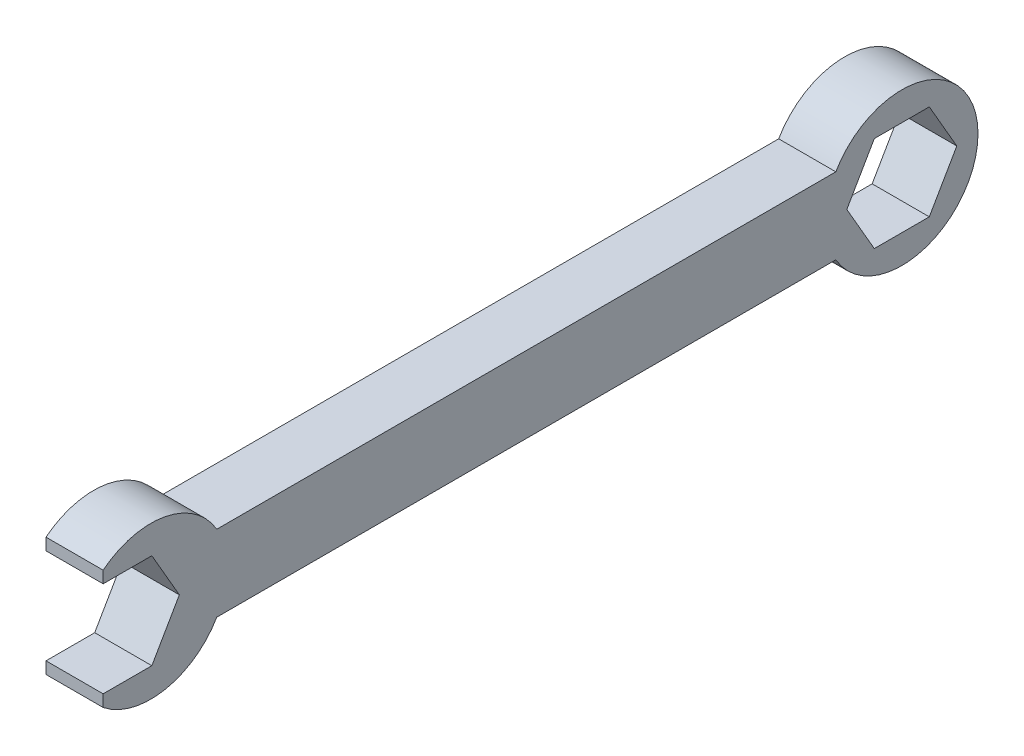
ISO-10303-21;
HEADER;
FILE_DESCRIPTION(('STEP AP214'),'2;1');
FILE_NAME('part.step','',(''),(''),'','','');
FILE_SCHEMA(('AUTOMOTIVE_DESIGN { 1 0 10303 214 1 1 1 1 }'));
ENDSEC;
DATA;
#1=APPLICATION_CONTEXT('core data for automotive mechanical design processes');
#2=APPLICATION_PROTOCOL_DEFINITION('international standard','automotive_design',2000,#1);
#3=PRODUCT_CONTEXT('',#1,'mechanical');
#4=PRODUCT('Part','Part','',(#3));
#5=PRODUCT_RELATED_PRODUCT_CATEGORY('part','',(#4));
#6=PRODUCT_DEFINITION_FORMATION('','',#4);
#7=PRODUCT_DEFINITION_CONTEXT('part definition',#1,'design');
#8=PRODUCT_DEFINITION('design','',#6,#7);
#9=PRODUCT_DEFINITION_SHAPE('','',#8);
#10=(LENGTH_UNIT() NAMED_UNIT(*) SI_UNIT(.MILLI.,.METRE.));
#11=(NAMED_UNIT(*) PLANE_ANGLE_UNIT() SI_UNIT($,.RADIAN.));
#12=(NAMED_UNIT(*) SI_UNIT($,.STERADIAN.) SOLID_ANGLE_UNIT());
#13=UNCERTAINTY_MEASURE_WITH_UNIT(LENGTH_MEASURE(1.E-05),#10,'distance_accuracy_value','');
#14=(GEOMETRIC_REPRESENTATION_CONTEXT(3) GLOBAL_UNCERTAINTY_ASSIGNED_CONTEXT((#13)) GLOBAL_UNIT_ASSIGNED_CONTEXT((#10,
#11,#12)) REPRESENTATION_CONTEXT('',''));
#15=CARTESIAN_POINT('',(0.,0.,0.));
#16=DIRECTION('',(0.,0.,1.));
#17=DIRECTION('',(1.,0.,0.));
#18=AXIS2_PLACEMENT_3D('',#15,#16,#17);
#19=CARTESIAN_POINT('',(7.62,0.,50.0738181024499));
#20=DIRECTION('',(1.,0.,0.));
#21=DIRECTION('',(0.,0.,-1.));
#22=AXIS2_PLACEMENT_3D('',#19,#20,#21);
#23=PLANE('',#22);
#24=CARTESIAN_POINT('',(7.62,0.,50.0738181024499));
#25=DIRECTION('',(1.,0.,0.));
#26=DIRECTION('',(0.,0.,-1.));
#27=AXIS2_PLACEMENT_3D('',#24,#25,#26);
#28=CIRCLE('',#27,10.16);
#29=CARTESIAN_POINT('',(7.62,5.08,41.275));
#30=VERTEX_POINT('',#29);
#31=CARTESIAN_POINT('',(7.62,7.93114745796596,56.4238181024499));
#32=VERTEX_POINT('',#31);
#33=EDGE_CURVE('E207',#30,#32,#28,.T.);
#34=ORIENTED_EDGE('',*,*,#33,.T.);
#35=DIRECTION('',(0.,-1.,0.));
#36=VECTOR('',#35,1.);
#37=CARTESIAN_POINT('',(7.62,7.93114745796596,56.4238181024499));
#38=LINE('',#37,#36);
#39=CARTESIAN_POINT('',(7.62,6.35,56.4238181024499));
#40=VERTEX_POINT('',#39);
#41=EDGE_CURVE('E210',#32,#40,#38,.T.);
#42=ORIENTED_EDGE('',*,*,#41,.T.);
#43=DIRECTION('',(0.,0.,-1.));
#44=VECTOR('',#43,1.);
#45=CARTESIAN_POINT('',(7.62,6.35,49.929992311804));
#46=LINE('',#45,#44);
#47=CARTESIAN_POINT('',(7.62,6.35,49.929992311804));
#48=VERTEX_POINT('',#47);
#49=EDGE_CURVE('E213',#40,#48,#46,.T.);
#50=ORIENTED_EDGE('',*,*,#49,.T.);
#51=DIRECTION('',(0.,-0.866025403784438,-0.500000000000001));
#52=VECTOR('',#51,1.);
#53=CARTESIAN_POINT('',(7.62,0.,46.2638181024499));
#54=LINE('',#53,#52);
#55=CARTESIAN_POINT('',(7.62,0.,46.2638181024499));
#56=VERTEX_POINT('',#55);
#57=EDGE_CURVE('E215',#48,#56,#54,.T.);
#58=ORIENTED_EDGE('',*,*,#57,.T.);
#59=DIRECTION('',(0.,-0.866025403784438,0.5));
#60=VECTOR('',#59,1.);
#61=CARTESIAN_POINT('',(7.62,-6.35,49.929992311804));
#62=LINE('',#61,#60);
#63=CARTESIAN_POINT('',(7.62,-6.35,49.929992311804));
#64=VERTEX_POINT('',#63);
#65=EDGE_CURVE('E217',#56,#64,#62,.T.);
#66=ORIENTED_EDGE('',*,*,#65,.T.);
#67=DIRECTION('',(0.,0.,1.));
#68=VECTOR('',#67,1.);
#69=CARTESIAN_POINT('',(7.62,-6.35,56.4238181024499));
#70=LINE('',#69,#68);
#71=CARTESIAN_POINT('',(7.62,-6.35,56.4238181024499));
#72=VERTEX_POINT('',#71);
#73=EDGE_CURVE('E219',#64,#72,#70,.T.);
#74=ORIENTED_EDGE('',*,*,#73,.T.);
#75=DIRECTION('',(0.,-1.,0.));
#76=VECTOR('',#75,1.);
#77=CARTESIAN_POINT('',(7.62,-7.93114745796596,56.4238181024499));
#78=LINE('',#77,#76);
#79=CARTESIAN_POINT('',(7.62,-7.93114745796596,56.4238181024499));
#80=VERTEX_POINT('',#79);
#81=EDGE_CURVE('E221',#72,#80,#78,.T.);
#82=ORIENTED_EDGE('',*,*,#81,.T.);
#83=CARTESIAN_POINT('',(7.62,0.,50.0738181024499));
#84=DIRECTION('',(1.,0.,0.));
#85=DIRECTION('',(0.,0.,1.));
#86=AXIS2_PLACEMENT_3D('',#83,#84,#85);
#87=CIRCLE('',#86,10.16);
#88=CARTESIAN_POINT('',(7.62,-5.08,41.275));
#89=VERTEX_POINT('',#88);
#90=EDGE_CURVE('E223',#80,#89,#87,.T.);
#91=ORIENTED_EDGE('',*,*,#90,.T.);
#92=DIRECTION('',(0.,0.,-1.));
#93=VECTOR('',#92,1.);
#94=CARTESIAN_POINT('',(7.62,-5.08,41.275));
#95=LINE('',#94,#93);
#96=CARTESIAN_POINT('',(7.62,-5.08,-41.275));
#97=VERTEX_POINT('',#96);
#98=EDGE_CURVE('E225',#89,#97,#95,.T.);
#99=ORIENTED_EDGE('',*,*,#98,.T.);
#100=CARTESIAN_POINT('',(7.62,0.,-50.0738181024499));
#101=DIRECTION('',(1.,0.,0.));
#102=DIRECTION('',(0.,0.,-1.));
#103=AXIS2_PLACEMENT_3D('',#100,#101,#102);
#104=CIRCLE('',#103,10.16);
#105=CARTESIAN_POINT('',(7.62,5.08,-41.275));
#106=VERTEX_POINT('',#105);
#107=EDGE_CURVE('E227',#97,#106,#104,.T.);
#108=ORIENTED_EDGE('',*,*,#107,.T.);
#109=DIRECTION('',(0.,0.,1.));
#110=VECTOR('',#109,1.);
#111=CARTESIAN_POINT('',(7.62,5.08,41.275));
#112=LINE('',#111,#110);
#113=EDGE_CURVE('E229',#106,#30,#112,.T.);
#114=ORIENTED_EDGE('',*,*,#113,.T.);
#115=EDGE_LOOP('',(#34,#42,#50,#58,#66,#74,#82,#91,#99,#108,#114));
#116=FACE_BOUND('',#115,.T.);
#117=DIRECTION('',(0.,0.866025403784439,0.5));
#118=VECTOR('',#117,1.);
#119=CARTESIAN_POINT('',(7.62,0.,-57.4061665211581));
#120=LINE('',#119,#118);
#121=CARTESIAN_POINT('',(7.62,0.,-57.4061665211581));
#122=VERTEX_POINT('',#121);
#123=CARTESIAN_POINT('',(7.62,6.35,-53.739992311804));
#124=VERTEX_POINT('',#123);
#125=EDGE_CURVE('E164',#122,#124,#120,.T.);
#126=ORIENTED_EDGE('',*,*,#125,.F.);
#127=DIRECTION('',(0.,0.866025403784439,-0.5));
#128=VECTOR('',#127,1.);
#129=CARTESIAN_POINT('',(7.62,-6.35,-53.739992311804));
#130=LINE('',#129,#128);
#131=CARTESIAN_POINT('',(7.62,-6.35,-53.739992311804));
#132=VERTEX_POINT('',#131);
#133=EDGE_CURVE('E156',#132,#122,#130,.T.);
#134=ORIENTED_EDGE('',*,*,#133,.F.);
#135=DIRECTION('',(0.,0.,-1.));
#136=VECTOR('',#135,1.);
#137=CARTESIAN_POINT('',(7.62,-6.35,-46.4076438930958));
#138=LINE('',#137,#136);
#139=CARTESIAN_POINT('',(7.62,-6.35,-46.4076438930958));
#140=VERTEX_POINT('',#139);
#141=EDGE_CURVE('E185',#140,#132,#138,.T.);
#142=ORIENTED_EDGE('',*,*,#141,.F.);
#143=DIRECTION('',(0.,-0.866025403784439,-0.499999999999999));
#144=VECTOR('',#143,1.);
#145=CARTESIAN_POINT('',(7.62,0.,-42.7414696837416));
#146=LINE('',#145,#144);
#147=CARTESIAN_POINT('',(7.62,0.,-42.7414696837416));
#148=VERTEX_POINT('',#147);
#149=EDGE_CURVE('E183',#148,#140,#146,.T.);
#150=ORIENTED_EDGE('',*,*,#149,.F.);
#151=DIRECTION('',(0.,-0.866025403784439,0.5));
#152=VECTOR('',#151,1.);
#153=CARTESIAN_POINT('',(7.62,6.35,-46.4076438930958));
#154=LINE('',#153,#152);
#155=CARTESIAN_POINT('',(7.62,6.35,-46.4076438930958));
#156=VERTEX_POINT('',#155);
#157=EDGE_CURVE('E179',#156,#148,#154,.T.);
#158=ORIENTED_EDGE('',*,*,#157,.F.);
#159=DIRECTION('',(0.,0.,1.));
#160=VECTOR('',#159,1.);
#161=CARTESIAN_POINT('',(7.62,6.35,-53.739992311804));
#162=LINE('',#161,#160);
#163=EDGE_CURVE('E177',#124,#156,#162,.T.);
#164=ORIENTED_EDGE('',*,*,#163,.F.);
#165=EDGE_LOOP('',(#126,#134,#142,#150,#158,#164));
#166=FACE_BOUND('',#165,.T.);
#167=ADVANCED_FACE('F37',(#116,#166),#23,.T.);
#168=CARTESIAN_POINT('',(0.,0.,50.0738181024499));
#169=DIRECTION('',(1.,0.,0.));
#170=DIRECTION('',(0.,0.,-1.));
#171=AXIS2_PLACEMENT_3D('',#168,#169,#170);
#172=PLANE('',#171);
#173=CARTESIAN_POINT('',(0.,0.,50.0738181024499));
#174=DIRECTION('',(1.,0.,0.));
#175=DIRECTION('',(0.,0.,-1.));
#176=AXIS2_PLACEMENT_3D('',#173,#174,#175);
#177=CIRCLE('',#176,10.16);
#178=CARTESIAN_POINT('',(0.,5.08,41.275));
#179=VERTEX_POINT('',#178);
#180=CARTESIAN_POINT('',(0.,7.93114745796596,56.4238181024499));
#181=VERTEX_POINT('',#180);
#182=EDGE_CURVE('E172',#179,#181,#177,.T.);
#183=ORIENTED_EDGE('',*,*,#182,.F.);
#184=DIRECTION('',(0.,0.,1.));
#185=VECTOR('',#184,1.);
#186=CARTESIAN_POINT('',(0.,5.08,41.275));
#187=LINE('',#186,#185);
#188=CARTESIAN_POINT('',(0.,5.08,-41.275));
#189=VERTEX_POINT('',#188);
#190=EDGE_CURVE('E211',#189,#179,#187,.T.);
#191=ORIENTED_EDGE('',*,*,#190,.F.);
#192=CARTESIAN_POINT('',(0.,0.,-50.0738181024499));
#193=DIRECTION('',(1.,0.,0.));
#194=DIRECTION('',(0.,0.,-1.));
#195=AXIS2_PLACEMENT_3D('',#192,#193,#194);
#196=CIRCLE('',#195,10.16);
#197=CARTESIAN_POINT('',(0.,-5.08,-41.275));
#198=VERTEX_POINT('',#197);
#199=EDGE_CURVE('E250',#198,#189,#196,.T.);
#200=ORIENTED_EDGE('',*,*,#199,.F.);
#201=DIRECTION('',(0.,0.,-1.));
#202=VECTOR('',#201,1.);
#203=CARTESIAN_POINT('',(0.,-5.08,41.275));
#204=LINE('',#203,#202);
#205=CARTESIAN_POINT('',(0.,-5.08,41.275));
#206=VERTEX_POINT('',#205);
#207=EDGE_CURVE('E248',#206,#198,#204,.T.);
#208=ORIENTED_EDGE('',*,*,#207,.F.);
#209=CARTESIAN_POINT('',(0.,0.,50.0738181024499));
#210=DIRECTION('',(1.,0.,0.));
#211=DIRECTION('',(0.,0.,1.));
#212=AXIS2_PLACEMENT_3D('',#209,#210,#211);
#213=CIRCLE('',#212,10.16);
#214=CARTESIAN_POINT('',(0.,-7.93114745796596,56.4238181024499));
#215=VERTEX_POINT('',#214);
#216=EDGE_CURVE('E246',#215,#206,#213,.T.);
#217=ORIENTED_EDGE('',*,*,#216,.F.);
#218=DIRECTION('',(0.,-1.,0.));
#219=VECTOR('',#218,1.);
#220=CARTESIAN_POINT('',(0.,-7.93114745796596,56.4238181024499));
#221=LINE('',#220,#219);
#222=CARTESIAN_POINT('',(0.,-6.35,56.4238181024499));
#223=VERTEX_POINT('',#222);
#224=EDGE_CURVE('E244',#223,#215,#221,.T.);
#225=ORIENTED_EDGE('',*,*,#224,.F.);
#226=DIRECTION('',(0.,0.,1.));
#227=VECTOR('',#226,1.);
#228=CARTESIAN_POINT('',(0.,-6.35,56.4238181024499));
#229=LINE('',#228,#227);
#230=CARTESIAN_POINT('',(0.,-6.35,49.929992311804));
#231=VERTEX_POINT('',#230);
#232=EDGE_CURVE('E242',#231,#223,#229,.T.);
#233=ORIENTED_EDGE('',*,*,#232,.F.);
#234=DIRECTION('',(0.,-0.866025403784438,0.5));
#235=VECTOR('',#234,1.);
#236=CARTESIAN_POINT('',(0.,-6.35,49.929992311804));
#237=LINE('',#236,#235);
#238=CARTESIAN_POINT('',(0.,0.,46.2638181024499));
#239=VERTEX_POINT('',#238);
#240=EDGE_CURVE('E240',#239,#231,#237,.T.);
#241=ORIENTED_EDGE('',*,*,#240,.F.);
#242=DIRECTION('',(0.,-0.866025403784438,-0.500000000000001));
#243=VECTOR('',#242,1.);
#244=CARTESIAN_POINT('',(0.,0.,46.2638181024499));
#245=LINE('',#244,#243);
#246=CARTESIAN_POINT('',(0.,6.35,49.929992311804));
#247=VERTEX_POINT('',#246);
#248=EDGE_CURVE('E238',#247,#239,#245,.T.);
#249=ORIENTED_EDGE('',*,*,#248,.F.);
#250=DIRECTION('',(0.,0.,-1.));
#251=VECTOR('',#250,1.);
#252=CARTESIAN_POINT('',(0.,6.35,49.929992311804));
#253=LINE('',#252,#251);
#254=CARTESIAN_POINT('',(0.,6.35,56.4238181024499));
#255=VERTEX_POINT('',#254);
#256=EDGE_CURVE('E236',#255,#247,#253,.T.);
#257=ORIENTED_EDGE('',*,*,#256,.F.);
#258=DIRECTION('',(0.,-1.,0.));
#259=VECTOR('',#258,1.);
#260=CARTESIAN_POINT('',(0.,7.93114745796596,56.4238181024499));
#261=LINE('',#260,#259);
#262=EDGE_CURVE('E234',#181,#255,#261,.T.);
#263=ORIENTED_EDGE('',*,*,#262,.F.);
#264=EDGE_LOOP('',(#183,#191,#200,#208,#217,#225,#233,#241,#249,#257,#263));
#265=FACE_BOUND('',#264,.T.);
#266=DIRECTION('',(0.,0.866025403784439,-0.5));
#267=VECTOR('',#266,1.);
#268=CARTESIAN_POINT('',(0.,-6.35,-53.739992311804));
#269=LINE('',#268,#267);
#270=CARTESIAN_POINT('',(0.,-6.35,-53.739992311804));
#271=VERTEX_POINT('',#270);
#272=CARTESIAN_POINT('',(0.,0.,-57.4061665211581));
#273=VERTEX_POINT('',#272);
#274=EDGE_CURVE('E60',#271,#273,#269,.T.);
#275=ORIENTED_EDGE('',*,*,#274,.T.);
#276=DIRECTION('',(0.,0.866025403784439,0.5));
#277=VECTOR('',#276,1.);
#278=CARTESIAN_POINT('',(0.,0.,-57.4061665211581));
#279=LINE('',#278,#277);
#280=CARTESIAN_POINT('',(0.,6.35,-53.739992311804));
#281=VERTEX_POINT('',#280);
#282=EDGE_CURVE('E171',#273,#281,#279,.T.);
#283=ORIENTED_EDGE('',*,*,#282,.T.);
#284=DIRECTION('',(0.,0.,1.));
#285=VECTOR('',#284,1.);
#286=CARTESIAN_POINT('',(0.,6.35,-53.739992311804));
#287=LINE('',#286,#285);
#288=CARTESIAN_POINT('',(0.,6.35,-46.4076438930958));
#289=VERTEX_POINT('',#288);
#290=EDGE_CURVE('E189',#281,#289,#287,.T.);
#291=ORIENTED_EDGE('',*,*,#290,.T.);
#292=DIRECTION('',(0.,-0.866025403784439,0.5));
#293=VECTOR('',#292,1.);
#294=CARTESIAN_POINT('',(0.,6.35,-46.4076438930958));
#295=LINE('',#294,#293);
#296=CARTESIAN_POINT('',(0.,0.,-42.7414696837416));
#297=VERTEX_POINT('',#296);
#298=EDGE_CURVE('E192',#289,#297,#295,.T.);
#299=ORIENTED_EDGE('',*,*,#298,.T.);
#300=DIRECTION('',(0.,-0.866025403784439,-0.499999999999999));
#301=VECTOR('',#300,1.);
#302=CARTESIAN_POINT('',(0.,0.,-42.7414696837416));
#303=LINE('',#302,#301);
#304=CARTESIAN_POINT('',(0.,-6.35,-46.4076438930958));
#305=VERTEX_POINT('',#304);
#306=EDGE_CURVE('E195',#297,#305,#303,.T.);
#307=ORIENTED_EDGE('',*,*,#306,.T.);
#308=DIRECTION('',(0.,0.,-1.));
#309=VECTOR('',#308,1.);
#310=CARTESIAN_POINT('',(0.,-6.35,-46.4076438930958));
#311=LINE('',#310,#309);
#312=EDGE_CURVE('E165',#305,#271,#311,.T.);
#313=ORIENTED_EDGE('',*,*,#312,.T.);
#314=EDGE_LOOP('',(#275,#283,#291,#299,#307,#313));
#315=FACE_BOUND('',#314,.T.);
#316=ADVANCED_FACE('F289',(#265,#315),#172,.F.);
#317=CARTESIAN_POINT('',(7.62,0.,50.0738181024499));
#318=DIRECTION('',(-1.,0.,0.));
#319=DIRECTION('',(0.,0.,1.));
#320=AXIS2_PLACEMENT_3D('',#317,#318,#319);
#321=CYLINDRICAL_SURFACE('',#320,10.16);
#322=ORIENTED_EDGE('',*,*,#182,.T.);
#323=DIRECTION('',(-1.,0.,0.));
#324=VECTOR('',#323,1.);
#325=CARTESIAN_POINT('',(7.62,7.93114745796596,56.4238181024499));
#326=LINE('',#325,#324);
#327=EDGE_CURVE('E11',#32,#181,#326,.T.);
#328=ORIENTED_EDGE('',*,*,#327,.F.);
#329=ORIENTED_EDGE('',*,*,#33,.F.);
#330=DIRECTION('',(-1.,0.,0.));
#331=VECTOR('',#330,1.);
#332=CARTESIAN_POINT('',(7.62,5.08,41.275));
#333=LINE('',#332,#331);
#334=EDGE_CURVE('E231',#30,#179,#333,.T.);
#335=ORIENTED_EDGE('',*,*,#334,.T.);
#336=EDGE_LOOP('',(#322,#328,#329,#335));
#337=FACE_BOUND('',#336,.T.);
#338=ADVANCED_FACE('F39',(#337),#321,.T.);
#339=CARTESIAN_POINT('',(7.62,7.93114745796596,56.4238181024499));
#340=DIRECTION('',(0.,0.,-1.));
#341=DIRECTION('',(-1.,0.,0.));
#342=AXIS2_PLACEMENT_3D('',#339,#340,#341);
#343=PLANE('',#342);
#344=ORIENTED_EDGE('',*,*,#262,.T.);
#345=DIRECTION('',(-1.,0.,0.));
#346=VECTOR('',#345,1.);
#347=CARTESIAN_POINT('',(7.62,6.35,56.4238181024499));
#348=LINE('',#347,#346);
#349=EDGE_CURVE('E45',#40,#255,#348,.T.);
#350=ORIENTED_EDGE('',*,*,#349,.F.);
#351=ORIENTED_EDGE('',*,*,#41,.F.);
#352=ORIENTED_EDGE('',*,*,#327,.T.);
#353=EDGE_LOOP('',(#344,#350,#351,#352));
#354=FACE_BOUND('',#353,.T.);
#355=ADVANCED_FACE('F306',(#354),#343,.F.);
#356=CARTESIAN_POINT('',(7.62,6.35,49.929992311804));
#357=DIRECTION('',(0.,1.,0.));
#358=DIRECTION('',(0.,0.,1.));
#359=AXIS2_PLACEMENT_3D('',#356,#357,#358);
#360=PLANE('',#359);
#361=ORIENTED_EDGE('',*,*,#256,.T.);
#362=DIRECTION('',(-1.,0.,0.));
#363=VECTOR('',#362,1.);
#364=CARTESIAN_POINT('',(7.62,6.35,49.929992311804));
#365=LINE('',#364,#363);
#366=EDGE_CURVE('E276',#48,#247,#365,.T.);
#367=ORIENTED_EDGE('',*,*,#366,.F.);
#368=ORIENTED_EDGE('',*,*,#49,.F.);
#369=ORIENTED_EDGE('',*,*,#349,.T.);
#370=EDGE_LOOP('',(#361,#367,#368,#369));
#371=FACE_BOUND('',#370,.T.);
#372=ADVANCED_FACE('F283',(#371),#360,.F.);
#373=CARTESIAN_POINT('',(7.62,0.,46.2638181024499));
#374=DIRECTION('',(0.,0.500000000000001,-0.866025403784438));
#375=DIRECTION('',(0.,0.866025403784438,0.500000000000001));
#376=AXIS2_PLACEMENT_3D('',#373,#374,#375);
#377=PLANE('',#376);
#378=ORIENTED_EDGE('',*,*,#248,.T.);
#379=DIRECTION('',(-1.,0.,0.));
#380=VECTOR('',#379,1.);
#381=CARTESIAN_POINT('',(7.62,0.,46.2638181024499));
#382=LINE('',#381,#380);
#383=EDGE_CURVE('E273',#56,#239,#382,.T.);
#384=ORIENTED_EDGE('',*,*,#383,.F.);
#385=ORIENTED_EDGE('',*,*,#57,.F.);
#386=ORIENTED_EDGE('',*,*,#366,.T.);
#387=EDGE_LOOP('',(#378,#384,#385,#386));
#388=FACE_BOUND('',#387,.T.);
#389=ADVANCED_FACE('F295',(#388),#377,.F.);
#390=CARTESIAN_POINT('',(7.62,-6.35,49.929992311804));
#391=DIRECTION('',(0.,-0.5,-0.866025403784438));
#392=DIRECTION('',(0.,0.866025403784439,-0.5));
#393=AXIS2_PLACEMENT_3D('',#390,#391,#392);
#394=PLANE('',#393);
#395=ORIENTED_EDGE('',*,*,#240,.T.);
#396=DIRECTION('',(-1.,0.,0.));
#397=VECTOR('',#396,1.);
#398=CARTESIAN_POINT('',(7.62,-6.35,49.929992311804));
#399=LINE('',#398,#397);
#400=EDGE_CURVE('E270',#64,#231,#399,.T.);
#401=ORIENTED_EDGE('',*,*,#400,.F.);
#402=ORIENTED_EDGE('',*,*,#65,.F.);
#403=ORIENTED_EDGE('',*,*,#383,.T.);
#404=EDGE_LOOP('',(#395,#401,#402,#403));
#405=FACE_BOUND('',#404,.T.);
#406=ADVANCED_FACE('F299',(#405),#394,.F.);
#407=CARTESIAN_POINT('',(7.62,-6.35,56.4238181024499));
#408=DIRECTION('',(0.,-1.,0.));
#409=DIRECTION('',(0.,0.,-1.));
#410=AXIS2_PLACEMENT_3D('',#407,#408,#409);
#411=PLANE('',#410);
#412=ORIENTED_EDGE('',*,*,#232,.T.);
#413=DIRECTION('',(-1.,0.,0.));
#414=VECTOR('',#413,1.);
#415=CARTESIAN_POINT('',(7.62,-6.35,56.4238181024499));
#416=LINE('',#415,#414);
#417=EDGE_CURVE('E267',#72,#223,#416,.T.);
#418=ORIENTED_EDGE('',*,*,#417,.F.);
#419=ORIENTED_EDGE('',*,*,#73,.F.);
#420=ORIENTED_EDGE('',*,*,#400,.T.);
#421=EDGE_LOOP('',(#412,#418,#419,#420));
#422=FACE_BOUND('',#421,.T.);
#423=ADVANCED_FACE('F334',(#422),#411,.F.);
#424=CARTESIAN_POINT('',(7.62,-7.93114745796596,56.4238181024499));
#425=DIRECTION('',(0.,0.,-1.));
#426=DIRECTION('',(-1.,0.,0.));
#427=AXIS2_PLACEMENT_3D('',#424,#425,#426);
#428=PLANE('',#427);
#429=ORIENTED_EDGE('',*,*,#224,.T.);
#430=DIRECTION('',(-1.,0.,0.));
#431=VECTOR('',#430,1.);
#432=CARTESIAN_POINT('',(7.62,-7.93114745796596,56.4238181024499));
#433=LINE('',#432,#431);
#434=EDGE_CURVE('E264',#80,#215,#433,.T.);
#435=ORIENTED_EDGE('',*,*,#434,.F.);
#436=ORIENTED_EDGE('',*,*,#81,.F.);
#437=ORIENTED_EDGE('',*,*,#417,.T.);
#438=EDGE_LOOP('',(#429,#435,#436,#437));
#439=FACE_BOUND('',#438,.T.);
#440=ADVANCED_FACE('F332',(#439),#428,.F.);
#441=CARTESIAN_POINT('',(7.62,0.,50.0738181024499));
#442=DIRECTION('',(-1.,0.,0.));
#443=DIRECTION('',(0.,0.,1.));
#444=AXIS2_PLACEMENT_3D('',#441,#442,#443);
#445=CYLINDRICAL_SURFACE('',#444,10.16);
#446=ORIENTED_EDGE('',*,*,#216,.T.);
#447=DIRECTION('',(-1.,0.,0.));
#448=VECTOR('',#447,1.);
#449=CARTESIAN_POINT('',(7.62,-5.08,41.275));
#450=LINE('',#449,#448);
#451=EDGE_CURVE('E261',#89,#206,#450,.T.);
#452=ORIENTED_EDGE('',*,*,#451,.F.);
#453=ORIENTED_EDGE('',*,*,#90,.F.);
#454=ORIENTED_EDGE('',*,*,#434,.T.);
#455=EDGE_LOOP('',(#446,#452,#453,#454));
#456=FACE_BOUND('',#455,.T.);
#457=ADVANCED_FACE('F327',(#456),#445,.T.);
#458=CARTESIAN_POINT('',(7.62,-5.08,41.275));
#459=DIRECTION('',(0.,1.,0.));
#460=DIRECTION('',(0.,0.,1.));
#461=AXIS2_PLACEMENT_3D('',#458,#459,#460);
#462=PLANE('',#461);
#463=ORIENTED_EDGE('',*,*,#207,.T.);
#464=DIRECTION('',(-1.,0.,0.));
#465=VECTOR('',#464,1.);
#466=CARTESIAN_POINT('',(7.62,-5.08,-41.275));
#467=LINE('',#466,#465);
#468=EDGE_CURVE('E258',#97,#198,#467,.T.);
#469=ORIENTED_EDGE('',*,*,#468,.F.);
#470=ORIENTED_EDGE('',*,*,#98,.F.);
#471=ORIENTED_EDGE('',*,*,#451,.T.);
#472=EDGE_LOOP('',(#463,#469,#470,#471));
#473=FACE_BOUND('',#472,.T.);
#474=ADVANCED_FACE('F322',(#473),#462,.F.);
#475=CARTESIAN_POINT('',(7.62,0.,-50.0738181024499));
#476=DIRECTION('',(-1.,0.,0.));
#477=DIRECTION('',(0.,0.,1.));
#478=AXIS2_PLACEMENT_3D('',#475,#476,#477);
#479=CYLINDRICAL_SURFACE('',#478,10.16);
#480=ORIENTED_EDGE('',*,*,#199,.T.);
#481=DIRECTION('',(-1.,0.,0.));
#482=VECTOR('',#481,1.);
#483=CARTESIAN_POINT('',(7.62,5.08,-41.275));
#484=LINE('',#483,#482);
#485=EDGE_CURVE('E255',#106,#189,#484,.T.);
#486=ORIENTED_EDGE('',*,*,#485,.F.);
#487=ORIENTED_EDGE('',*,*,#107,.F.);
#488=ORIENTED_EDGE('',*,*,#468,.T.);
#489=EDGE_LOOP('',(#480,#486,#487,#488));
#490=FACE_BOUND('',#489,.T.);
#491=ADVANCED_FACE('F318',(#490),#479,.T.);
#492=CARTESIAN_POINT('',(7.62,5.08,41.275));
#493=DIRECTION('',(0.,-1.,0.));
#494=DIRECTION('',(0.,0.,-1.));
#495=AXIS2_PLACEMENT_3D('',#492,#493,#494);
#496=PLANE('',#495);
#497=ORIENTED_EDGE('',*,*,#190,.T.);
#498=ORIENTED_EDGE('',*,*,#334,.F.);
#499=ORIENTED_EDGE('',*,*,#113,.F.);
#500=ORIENTED_EDGE('',*,*,#485,.T.);
#501=EDGE_LOOP('',(#497,#498,#499,#500));
#502=FACE_BOUND('',#501,.T.);
#503=ADVANCED_FACE('F313',(#502),#496,.F.);
#504=CARTESIAN_POINT('',(7.62,-6.35,-53.739992311804));
#505=DIRECTION('',(0.,0.5,0.866025403784439));
#506=DIRECTION('',(0.,-0.866025403784439,0.5));
#507=AXIS2_PLACEMENT_3D('',#504,#505,#506);
#508=PLANE('',#507);
#509=ORIENTED_EDGE('',*,*,#274,.F.);
#510=DIRECTION('',(-1.,0.,0.));
#511=VECTOR('',#510,1.);
#512=CARTESIAN_POINT('',(7.62,-6.35,-53.739992311804));
#513=LINE('',#512,#511);
#514=EDGE_CURVE('E160',#132,#271,#513,.T.);
#515=ORIENTED_EDGE('',*,*,#514,.F.);
#516=ORIENTED_EDGE('',*,*,#133,.T.);
#517=DIRECTION('',(-1.,0.,0.));
#518=VECTOR('',#517,1.);
#519=CARTESIAN_POINT('',(7.62,0.,-57.4061665211581));
#520=LINE('',#519,#518);
#521=EDGE_CURVE('E159',#122,#273,#520,.T.);
#522=ORIENTED_EDGE('',*,*,#521,.T.);
#523=EDGE_LOOP('',(#509,#515,#516,#522));
#524=FACE_BOUND('',#523,.T.);
#525=ADVANCED_FACE('F158',(#524),#508,.T.);
#526=CARTESIAN_POINT('',(7.62,0.,-57.4061665211581));
#527=DIRECTION('',(0.,-0.5,0.866025403784439));
#528=DIRECTION('',(0.,-0.866025403784439,-0.5));
#529=AXIS2_PLACEMENT_3D('',#526,#527,#528);
#530=PLANE('',#529);
#531=ORIENTED_EDGE('',*,*,#282,.F.);
#532=ORIENTED_EDGE('',*,*,#521,.F.);
#533=ORIENTED_EDGE('',*,*,#125,.T.);
#534=DIRECTION('',(-1.,0.,0.));
#535=VECTOR('',#534,1.);
#536=CARTESIAN_POINT('',(7.62,6.35,-53.739992311804));
#537=LINE('',#536,#535);
#538=EDGE_CURVE('E173',#124,#281,#537,.T.);
#539=ORIENTED_EDGE('',*,*,#538,.T.);
#540=EDGE_LOOP('',(#531,#532,#533,#539));
#541=FACE_BOUND('',#540,.T.);
#542=ADVANCED_FACE('F168',(#541),#530,.T.);
#543=CARTESIAN_POINT('',(7.62,6.35,-53.739992311804));
#544=DIRECTION('',(0.,-1.,0.));
#545=DIRECTION('',(0.,0.,-1.));
#546=AXIS2_PLACEMENT_3D('',#543,#544,#545);
#547=PLANE('',#546);
#548=ORIENTED_EDGE('',*,*,#290,.F.);
#549=ORIENTED_EDGE('',*,*,#538,.F.);
#550=ORIENTED_EDGE('',*,*,#163,.T.);
#551=DIRECTION('',(-1.,0.,0.));
#552=VECTOR('',#551,1.);
#553=CARTESIAN_POINT('',(7.62,6.35,-46.4076438930958));
#554=LINE('',#553,#552);
#555=EDGE_CURVE('E204',#156,#289,#554,.T.);
#556=ORIENTED_EDGE('',*,*,#555,.T.);
#557=EDGE_LOOP('',(#548,#549,#550,#556));
#558=FACE_BOUND('',#557,.T.);
#559=ADVANCED_FACE('F386',(#558),#547,.T.);
#560=CARTESIAN_POINT('',(7.62,6.35,-46.4076438930958));
#561=DIRECTION('',(0.,-0.5,-0.866025403784439));
#562=DIRECTION('',(0.,0.866025403784439,-0.5));
#563=AXIS2_PLACEMENT_3D('',#560,#561,#562);
#564=PLANE('',#563);
#565=ORIENTED_EDGE('',*,*,#298,.F.);
#566=ORIENTED_EDGE('',*,*,#555,.F.);
#567=ORIENTED_EDGE('',*,*,#157,.T.);
#568=DIRECTION('',(-1.,0.,0.));
#569=VECTOR('',#568,1.);
#570=CARTESIAN_POINT('',(7.62,0.,-42.7414696837416));
#571=LINE('',#570,#569);
#572=EDGE_CURVE('E202',#148,#297,#571,.T.);
#573=ORIENTED_EDGE('',*,*,#572,.T.);
#574=EDGE_LOOP('',(#565,#566,#567,#573));
#575=FACE_BOUND('',#574,.T.);
#576=ADVANCED_FACE('F392',(#575),#564,.T.);
#577=CARTESIAN_POINT('',(7.62,0.,-42.7414696837416));
#578=DIRECTION('',(0.,0.499999999999999,-0.866025403784439));
#579=DIRECTION('',(0.,0.866025403784439,0.499999999999999));
#580=AXIS2_PLACEMENT_3D('',#577,#578,#579);
#581=PLANE('',#580);
#582=ORIENTED_EDGE('',*,*,#306,.F.);
#583=ORIENTED_EDGE('',*,*,#572,.F.);
#584=ORIENTED_EDGE('',*,*,#149,.T.);
#585=DIRECTION('',(-1.,0.,0.));
#586=VECTOR('',#585,1.);
#587=CARTESIAN_POINT('',(7.62,-6.35,-46.4076438930958));
#588=LINE('',#587,#586);
#589=EDGE_CURVE('E52',#140,#305,#588,.T.);
#590=ORIENTED_EDGE('',*,*,#589,.T.);
#591=EDGE_LOOP('',(#582,#583,#584,#590));
#592=FACE_BOUND('',#591,.T.);
#593=ADVANCED_FACE('F400',(#592),#581,.T.);
#594=CARTESIAN_POINT('',(7.62,-6.35,-46.4076438930958));
#595=DIRECTION('',(0.,1.,0.));
#596=DIRECTION('',(0.,0.,1.));
#597=AXIS2_PLACEMENT_3D('',#594,#595,#596);
#598=PLANE('',#597);
#599=ORIENTED_EDGE('',*,*,#312,.F.);
#600=ORIENTED_EDGE('',*,*,#589,.F.);
#601=ORIENTED_EDGE('',*,*,#141,.T.);
#602=ORIENTED_EDGE('',*,*,#514,.T.);
#603=EDGE_LOOP('',(#599,#600,#601,#602));
#604=FACE_BOUND('',#603,.T.);
#605=ADVANCED_FACE('F408',(#604),#598,.T.);
#606=CLOSED_SHELL('',(#167,#316,#338,#355,#372,#389,#406,#423,#440,#457,#474,#491,#503,#525,
#542,#559,#576,#593,#605));
#607=MANIFOLD_SOLID_BREP('B2',#606);
#608=ADVANCED_BREP_SHAPE_REPRESENTATION('',(#18,#607),#14);
#609=SHAPE_DEFINITION_REPRESENTATION(#9,#608);
ENDSEC;
END-ISO-10303-21;
